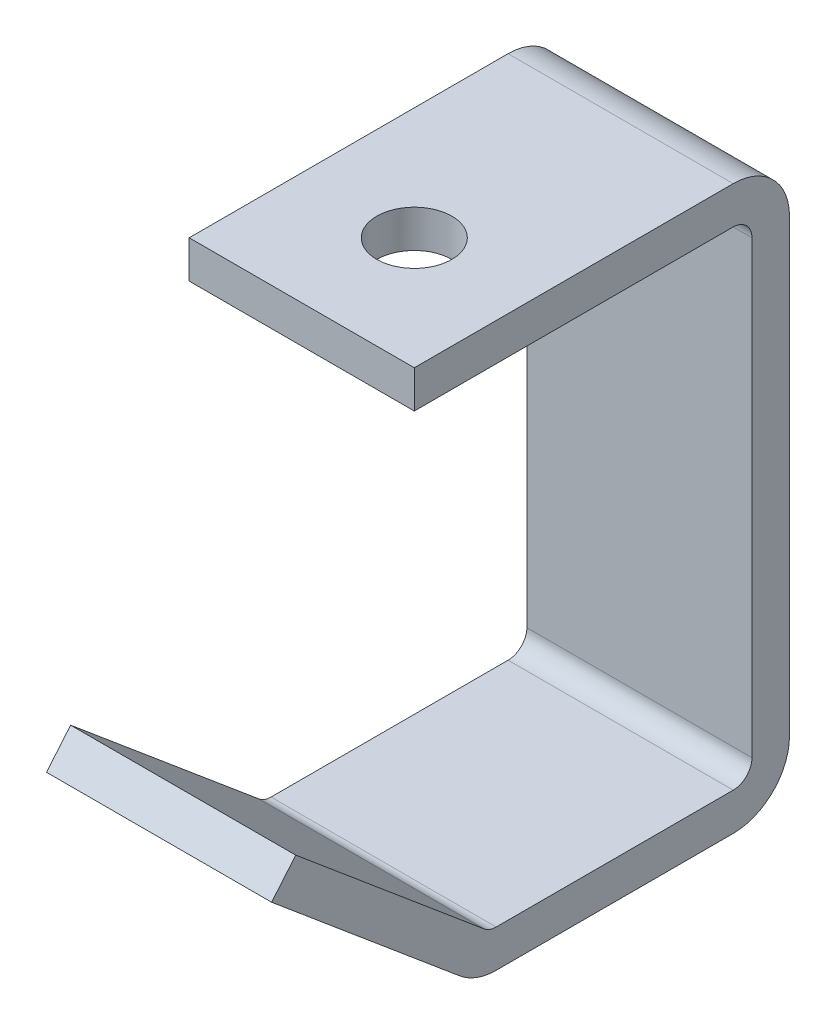
ISO-10303-21;
HEADER;
FILE_DESCRIPTION(('STEP AP214'),'2;1');
FILE_NAME('part.step','',(''),(''),'','','');
FILE_SCHEMA(('AUTOMOTIVE_DESIGN { 1 0 10303 214 1 1 1 1 }'));
ENDSEC;
DATA;
#1=APPLICATION_CONTEXT('core data for automotive mechanical design processes');
#2=APPLICATION_PROTOCOL_DEFINITION('international standard','automotive_design',2000,#1);
#3=PRODUCT_CONTEXT('',#1,'mechanical');
#4=PRODUCT('Part','Part','',(#3));
#5=PRODUCT_RELATED_PRODUCT_CATEGORY('part','',(#4));
#6=PRODUCT_DEFINITION_FORMATION('','',#4);
#7=PRODUCT_DEFINITION_CONTEXT('part definition',#1,'design');
#8=PRODUCT_DEFINITION('design','',#6,#7);
#9=PRODUCT_DEFINITION_SHAPE('','',#8);
#10=(LENGTH_UNIT() NAMED_UNIT(*) SI_UNIT(.MILLI.,.METRE.));
#11=(NAMED_UNIT(*) PLANE_ANGLE_UNIT() SI_UNIT($,.RADIAN.));
#12=(NAMED_UNIT(*) SI_UNIT($,.STERADIAN.) SOLID_ANGLE_UNIT());
#13=UNCERTAINTY_MEASURE_WITH_UNIT(LENGTH_MEASURE(1.E-05),#10,'distance_accuracy_value','');
#14=(GEOMETRIC_REPRESENTATION_CONTEXT(3) GLOBAL_UNCERTAINTY_ASSIGNED_CONTEXT((#13)) GLOBAL_UNIT_ASSIGNED_CONTEXT((#10,
#11,#12)) REPRESENTATION_CONTEXT('',''));
#15=CARTESIAN_POINT('',(0.,0.,0.));
#16=DIRECTION('',(0.,0.,1.));
#17=DIRECTION('',(1.,0.,0.));
#18=AXIS2_PLACEMENT_3D('',#15,#16,#17);
#19=CARTESIAN_POINT('',(19.05,88.9,3.175));
#20=DIRECTION('',(0.,-1.,0.));
#21=DIRECTION('',(0.,0.,-1.));
#22=AXIS2_PLACEMENT_3D('',#19,#20,#21);
#23=PLANE('',#22);
#24=CARTESIAN_POINT('',(0.,88.9,38.1));
#25=DIRECTION('',(0.,1.,0.));
#26=DIRECTION('',(0.,0.,1.));
#27=AXIS2_PLACEMENT_3D('',#24,#25,#26);
#28=CIRCLE('',#27,6.35);
#29=CARTESIAN_POINT('',(0.,88.9,44.45));
#30=VERTEX_POINT('',#29);
#31=EDGE_CURVE('E218',#30,#30,#28,.T.);
#32=ORIENTED_EDGE('',*,*,#31,.F.);
#33=EDGE_LOOP('',(#32));
#34=FACE_BOUND('',#33,.T.);
#35=DIRECTION('',(0.,0.,1.));
#36=VECTOR('',#35,1.);
#37=CARTESIAN_POINT('',(-19.05,88.9,3.175));
#38=LINE('',#37,#36);
#39=CARTESIAN_POINT('',(-19.05,88.9,3.175));
#40=VERTEX_POINT('',#39);
#41=CARTESIAN_POINT('',(-19.05,88.9,57.15));
#42=VERTEX_POINT('',#41);
#43=EDGE_CURVE('E213',#40,#42,#38,.T.);
#44=ORIENTED_EDGE('',*,*,#43,.T.);
#45=DIRECTION('',(-1.,0.,0.));
#46=VECTOR('',#45,1.);
#47=CARTESIAN_POINT('',(19.05,88.9,57.15));
#48=LINE('',#47,#46);
#49=CARTESIAN_POINT('',(19.05,88.9,57.15));
#50=VERTEX_POINT('',#49);
#51=EDGE_CURVE('E11',#50,#42,#48,.T.);
#52=ORIENTED_EDGE('',*,*,#51,.F.);
#53=DIRECTION('',(0.,0.,1.));
#54=VECTOR('',#53,1.);
#55=CARTESIAN_POINT('',(19.05,88.9,3.175));
#56=LINE('',#55,#54);
#57=CARTESIAN_POINT('',(19.05,88.9,3.175));
#58=VERTEX_POINT('',#57);
#59=EDGE_CURVE('E136',#58,#50,#56,.T.);
#60=ORIENTED_EDGE('',*,*,#59,.F.);
#61=DIRECTION('',(-1.,0.,0.));
#62=VECTOR('',#61,1.);
#63=CARTESIAN_POINT('',(19.05,88.9,3.175));
#64=LINE('',#63,#62);
#65=EDGE_CURVE('E209',#58,#40,#64,.T.);
#66=ORIENTED_EDGE('',*,*,#65,.T.);
#67=EDGE_LOOP('',(#44,#52,#60,#66));
#68=FACE_BOUND('',#67,.T.);
#69=ADVANCED_FACE('F38',(#34,#68),#23,.F.);
#70=CARTESIAN_POINT('',(19.05,82.55,57.15));
#71=DIRECTION('',(0.,0.,1.));
#72=DIRECTION('',(1.,0.,0.));
#73=AXIS2_PLACEMENT_3D('',#70,#71,#72);
#74=PLANE('',#73);
#75=DIRECTION('',(0.,1.,0.));
#76=VECTOR('',#75,1.);
#77=CARTESIAN_POINT('',(-19.05,82.55,57.15));
#78=LINE('',#77,#76);
#79=CARTESIAN_POINT('',(-19.05,82.55,57.15));
#80=VERTEX_POINT('',#79);
#81=EDGE_CURVE('E217',#80,#42,#78,.T.);
#82=ORIENTED_EDGE('',*,*,#81,.F.);
#83=DIRECTION('',(-1.,0.,0.));
#84=VECTOR('',#83,1.);
#85=CARTESIAN_POINT('',(19.05,82.55,57.15));
#86=LINE('',#85,#84);
#87=CARTESIAN_POINT('',(19.05,82.55,57.15));
#88=VERTEX_POINT('',#87);
#89=EDGE_CURVE('E47',#88,#80,#86,.T.);
#90=ORIENTED_EDGE('',*,*,#89,.F.);
#91=DIRECTION('',(0.,1.,0.));
#92=VECTOR('',#91,1.);
#93=CARTESIAN_POINT('',(19.05,82.55,57.15));
#94=LINE('',#93,#92);
#95=EDGE_CURVE('E328',#88,#50,#94,.T.);
#96=ORIENTED_EDGE('',*,*,#95,.T.);
#97=ORIENTED_EDGE('',*,*,#51,.T.);
#98=EDGE_LOOP('',(#82,#90,#96,#97));
#99=FACE_BOUND('',#98,.T.);
#100=ADVANCED_FACE('F315',(#99),#74,.T.);
#101=CARTESIAN_POINT('',(19.05,82.55,3.175));
#102=DIRECTION('',(0.,-1.,0.));
#103=DIRECTION('',(0.,0.,-1.));
#104=AXIS2_PLACEMENT_3D('',#101,#102,#103);
#105=PLANE('',#104);
#106=CARTESIAN_POINT('',(0.,82.55,38.1));
#107=DIRECTION('',(0.,-1.,0.));
#108=DIRECTION('',(0.,0.,-1.));
#109=AXIS2_PLACEMENT_3D('',#106,#107,#108);
#110=CIRCLE('',#109,6.35);
#111=CARTESIAN_POINT('',(0.,82.55,31.75));
#112=VERTEX_POINT('',#111);
#113=EDGE_CURVE('E396',#112,#112,#110,.F.);
#114=ORIENTED_EDGE('',*,*,#113,.T.);
#115=EDGE_LOOP('',(#114));
#116=FACE_BOUND('',#115,.T.);
#117=DIRECTION('',(0.,0.,1.));
#118=VECTOR('',#117,1.);
#119=CARTESIAN_POINT('',(-19.05,82.55,3.175));
#120=LINE('',#119,#118);
#121=CARTESIAN_POINT('',(-19.05,82.55,3.175));
#122=VERTEX_POINT('',#121);
#123=EDGE_CURVE('E221',#122,#80,#120,.T.);
#124=ORIENTED_EDGE('',*,*,#123,.F.);
#125=DIRECTION('',(-1.,0.,0.));
#126=VECTOR('',#125,1.);
#127=CARTESIAN_POINT('',(19.05,82.55,3.175));
#128=LINE('',#127,#126);
#129=CARTESIAN_POINT('',(19.05,82.55,3.175));
#130=VERTEX_POINT('',#129);
#131=EDGE_CURVE('E301',#130,#122,#128,.T.);
#132=ORIENTED_EDGE('',*,*,#131,.F.);
#133=DIRECTION('',(0.,0.,1.));
#134=VECTOR('',#133,1.);
#135=CARTESIAN_POINT('',(19.05,82.55,3.175));
#136=LINE('',#135,#134);
#137=EDGE_CURVE('E312',#130,#88,#136,.T.);
#138=ORIENTED_EDGE('',*,*,#137,.T.);
#139=ORIENTED_EDGE('',*,*,#89,.T.);
#140=EDGE_LOOP('',(#124,#132,#138,#139));
#141=FACE_BOUND('',#140,.T.);
#142=ADVANCED_FACE('F310',(#116,#141),#105,.T.);
#143=CARTESIAN_POINT('',(19.05,79.375,3.175));
#144=DIRECTION('',(-1.,0.,0.));
#145=DIRECTION('',(0.,0.,1.));
#146=AXIS2_PLACEMENT_3D('',#143,#144,#145);
#147=CYLINDRICAL_SURFACE('',#146,3.175);
#148=CARTESIAN_POINT('',(-19.05,79.375,3.175));
#149=DIRECTION('',(1.,0.,0.));
#150=DIRECTION('',(0.,0.,-1.));
#151=AXIS2_PLACEMENT_3D('',#148,#149,#150);
#152=CIRCLE('',#151,3.175);
#153=CARTESIAN_POINT('',(-19.05,79.375,0.));
#154=VERTEX_POINT('',#153);
#155=EDGE_CURVE('E225',#154,#122,#152,.T.);
#156=ORIENTED_EDGE('',*,*,#155,.F.);
#157=DIRECTION('',(-1.,0.,0.));
#158=VECTOR('',#157,1.);
#159=CARTESIAN_POINT('',(19.05,79.375,0.));
#160=LINE('',#159,#158);
#161=CARTESIAN_POINT('',(19.05,79.375,0.));
#162=VERTEX_POINT('',#161);
#163=EDGE_CURVE('E299',#162,#154,#160,.T.);
#164=ORIENTED_EDGE('',*,*,#163,.F.);
#165=CARTESIAN_POINT('',(19.05,79.375,3.175));
#166=DIRECTION('',(1.,0.,0.));
#167=DIRECTION('',(0.,0.,-1.));
#168=AXIS2_PLACEMENT_3D('',#165,#166,#167);
#169=CIRCLE('',#168,3.175);
#170=EDGE_CURVE('E325',#162,#130,#169,.T.);
#171=ORIENTED_EDGE('',*,*,#170,.T.);
#172=ORIENTED_EDGE('',*,*,#131,.T.);
#173=EDGE_LOOP('',(#156,#164,#171,#172));
#174=FACE_BOUND('',#173,.T.);
#175=ADVANCED_FACE('F322',(#174),#147,.F.);
#176=CARTESIAN_POINT('',(19.05,3.175,0.));
#177=DIRECTION('',(0.,0.,1.));
#178=DIRECTION('',(1.,0.,0.));
#179=AXIS2_PLACEMENT_3D('',#176,#177,#178);
#180=PLANE('',#179);
#181=DIRECTION('',(0.,1.,0.));
#182=VECTOR('',#181,1.);
#183=CARTESIAN_POINT('',(-19.05,3.175,0.));
#184=LINE('',#183,#182);
#185=CARTESIAN_POINT('',(-19.05,3.175,0.));
#186=VERTEX_POINT('',#185);
#187=EDGE_CURVE('E229',#186,#154,#184,.T.);
#188=ORIENTED_EDGE('',*,*,#187,.F.);
#189=DIRECTION('',(-1.,0.,0.));
#190=VECTOR('',#189,1.);
#191=CARTESIAN_POINT('',(19.05,3.175,0.));
#192=LINE('',#191,#190);
#193=CARTESIAN_POINT('',(19.05,3.175,0.));
#194=VERTEX_POINT('',#193);
#195=EDGE_CURVE('E296',#194,#186,#192,.T.);
#196=ORIENTED_EDGE('',*,*,#195,.F.);
#197=DIRECTION('',(0.,1.,0.));
#198=VECTOR('',#197,1.);
#199=CARTESIAN_POINT('',(19.05,3.175,0.));
#200=LINE('',#199,#198);
#201=EDGE_CURVE('E333',#194,#162,#200,.T.);
#202=ORIENTED_EDGE('',*,*,#201,.T.);
#203=ORIENTED_EDGE('',*,*,#163,.T.);
#204=EDGE_LOOP('',(#188,#196,#202,#203));
#205=FACE_BOUND('',#204,.T.);
#206=ADVANCED_FACE('F451',(#205),#180,.T.);
#207=CARTESIAN_POINT('',(19.05,3.175,3.175));
#208=DIRECTION('',(-1.,0.,0.));
#209=DIRECTION('',(0.,0.,1.));
#210=AXIS2_PLACEMENT_3D('',#207,#208,#209);
#211=CYLINDRICAL_SURFACE('',#210,3.175);
#212=CARTESIAN_POINT('',(-19.05,3.175,3.175));
#213=DIRECTION('',(1.,0.,0.));
#214=DIRECTION('',(0.,0.,1.));
#215=AXIS2_PLACEMENT_3D('',#212,#213,#214);
#216=CIRCLE('',#215,3.175);
#217=CARTESIAN_POINT('',(-19.05,0.,3.175));
#218=VERTEX_POINT('',#217);
#219=EDGE_CURVE('E233',#218,#186,#216,.T.);
#220=ORIENTED_EDGE('',*,*,#219,.F.);
#221=DIRECTION('',(-1.,0.,0.));
#222=VECTOR('',#221,1.);
#223=CARTESIAN_POINT('',(19.05,0.,3.175));
#224=LINE('',#223,#222);
#225=CARTESIAN_POINT('',(19.05,0.,3.175));
#226=VERTEX_POINT('',#225);
#227=EDGE_CURVE('E293',#226,#218,#224,.T.);
#228=ORIENTED_EDGE('',*,*,#227,.F.);
#229=CARTESIAN_POINT('',(19.05,3.175,3.175));
#230=DIRECTION('',(1.,0.,0.));
#231=DIRECTION('',(0.,0.,1.));
#232=AXIS2_PLACEMENT_3D('',#229,#230,#231);
#233=CIRCLE('',#232,3.175);
#234=EDGE_CURVE('E340',#226,#194,#233,.T.);
#235=ORIENTED_EDGE('',*,*,#234,.T.);
#236=ORIENTED_EDGE('',*,*,#195,.T.);
#237=EDGE_LOOP('',(#220,#228,#235,#236));
#238=FACE_BOUND('',#237,.T.);
#239=ADVANCED_FACE('F427',(#238),#211,.F.);
#240=CARTESIAN_POINT('',(19.05,0.,43.2943945062048));
#241=DIRECTION('',(0.,1.,0.));
#242=DIRECTION('',(0.,0.,1.));
#243=AXIS2_PLACEMENT_3D('',#240,#241,#242);
#244=PLANE('',#243);
#245=DIRECTION('',(0.,0.,-1.));
#246=VECTOR('',#245,1.);
#247=CARTESIAN_POINT('',(-19.05,0.,43.2943945062048));
#248=LINE('',#247,#246);
#249=CARTESIAN_POINT('',(-19.05,0.,43.2943945062048));
#250=VERTEX_POINT('',#249);
#251=EDGE_CURVE('E237',#250,#218,#248,.T.);
#252=ORIENTED_EDGE('',*,*,#251,.F.);
#253=DIRECTION('',(-1.,0.,0.));
#254=VECTOR('',#253,1.);
#255=CARTESIAN_POINT('',(19.05,0.,43.2943945062048));
#256=LINE('',#255,#254);
#257=CARTESIAN_POINT('',(19.05,0.,43.2943945062048));
#258=VERTEX_POINT('',#257);
#259=EDGE_CURVE('E290',#258,#250,#256,.T.);
#260=ORIENTED_EDGE('',*,*,#259,.F.);
#261=DIRECTION('',(0.,0.,-1.));
#262=VECTOR('',#261,1.);
#263=CARTESIAN_POINT('',(19.05,0.,43.2943945062048));
#264=LINE('',#263,#262);
#265=EDGE_CURVE('E344',#258,#226,#264,.T.);
#266=ORIENTED_EDGE('',*,*,#265,.T.);
#267=ORIENTED_EDGE('',*,*,#227,.T.);
#268=EDGE_LOOP('',(#252,#260,#266,#267));
#269=FACE_BOUND('',#268,.T.);
#270=ADVANCED_FACE('F422',(#269),#244,.T.);
#271=CARTESIAN_POINT('',(19.05,3.175,43.2943945062048));
#272=DIRECTION('',(-1.,0.,0.));
#273=DIRECTION('',(0.,0.,1.));
#274=AXIS2_PLACEMENT_3D('',#271,#272,#273);
#275=CYLINDRICAL_SURFACE('',#274,3.175);
#276=CARTESIAN_POINT('',(-19.05,3.175,43.2943945062048));
#277=DIRECTION('',(1.,0.,0.));
#278=DIRECTION('',(0.,0.,-1.));
#279=AXIS2_PLACEMENT_3D('',#276,#277,#278);
#280=CIRCLE('',#279,3.175);
#281=CARTESIAN_POINT('',(-19.05,0.742808893097251,45.3352451669596));
#282=VERTEX_POINT('',#281);
#283=EDGE_CURVE('E241',#282,#250,#280,.T.);
#284=ORIENTED_EDGE('',*,*,#283,.F.);
#285=DIRECTION('',(-1.,0.,0.));
#286=VECTOR('',#285,1.);
#287=CARTESIAN_POINT('',(19.05,0.742808893097251,45.3352451669596));
#288=LINE('',#287,#286);
#289=CARTESIAN_POINT('',(19.05,0.742808893097251,45.3352451669596));
#290=VERTEX_POINT('',#289);
#291=EDGE_CURVE('E287',#290,#282,#288,.T.);
#292=ORIENTED_EDGE('',*,*,#291,.F.);
#293=CARTESIAN_POINT('',(19.05,3.175,43.2943945062048));
#294=DIRECTION('',(1.,0.,0.));
#295=DIRECTION('',(0.,0.,-1.));
#296=AXIS2_PLACEMENT_3D('',#293,#294,#295);
#297=CIRCLE('',#296,3.175);
#298=EDGE_CURVE('E348',#290,#258,#297,.T.);
#299=ORIENTED_EDGE('',*,*,#298,.T.);
#300=ORIENTED_EDGE('',*,*,#259,.T.);
#301=EDGE_LOOP('',(#284,#292,#299,#300));
#302=FACE_BOUND('',#301,.T.);
#303=ADVANCED_FACE('F426',(#302),#275,.F.);
#304=CARTESIAN_POINT('',(19.05,27.4943401016882,77.2164785921939));
#305=DIRECTION('',(0.,0.766044443118977,-0.64278760968654));
#306=DIRECTION('',(0.,0.64278760968654,0.766044443118977));
#307=AXIS2_PLACEMENT_3D('',#304,#305,#306);
#308=PLANE('',#307);
#309=DIRECTION('',(0.,-0.64278760968654,-0.766044443118977));
#310=VECTOR('',#309,1.);
#311=CARTESIAN_POINT('',(-19.05,27.4943401016882,77.2164785921939));
#312=LINE('',#311,#310);
#313=CARTESIAN_POINT('',(-19.05,27.4943401016882,77.2164785921939));
#314=VERTEX_POINT('',#313);
#315=EDGE_CURVE('E244',#314,#282,#312,.T.);
#316=ORIENTED_EDGE('',*,*,#315,.F.);
#317=DIRECTION('',(-1.,0.,0.));
#318=VECTOR('',#317,1.);
#319=CARTESIAN_POINT('',(19.05,27.4943401016882,77.2164785921939));
#320=LINE('',#319,#318);
#321=CARTESIAN_POINT('',(19.05,27.4943401016882,77.2164785921939));
#322=VERTEX_POINT('',#321);
#323=EDGE_CURVE('E284',#322,#314,#320,.T.);
#324=ORIENTED_EDGE('',*,*,#323,.F.);
#325=DIRECTION('',(0.,-0.64278760968654,-0.766044443118977));
#326=VECTOR('',#325,1.);
#327=CARTESIAN_POINT('',(19.05,27.4943401016882,77.2164785921939));
#328=LINE('',#327,#326);
#329=EDGE_CURVE('E352',#322,#290,#328,.T.);
#330=ORIENTED_EDGE('',*,*,#329,.T.);
#331=ORIENTED_EDGE('',*,*,#291,.T.);
#332=EDGE_LOOP('',(#316,#324,#330,#331));
#333=FACE_BOUND('',#332,.T.);
#334=ADVANCED_FACE('F475',(#333),#308,.T.);
#335=CARTESIAN_POINT('',(19.05,22.6299578878827,81.2981799137034));
#336=DIRECTION('',(0.,0.642787609686541,0.766044443118977));
#337=DIRECTION('',(0.,-0.766044443118977,0.642787609686541));
#338=AXIS2_PLACEMENT_3D('',#335,#336,#337);
#339=PLANE('',#338);
#340=DIRECTION('',(0.,0.766044443118977,-0.642787609686541));
#341=VECTOR('',#340,1.);
#342=CARTESIAN_POINT('',(-19.05,22.6299578878827,81.2981799137034));
#343=LINE('',#342,#341);
#344=CARTESIAN_POINT('',(-19.05,22.6299578878827,81.2981799137034));
#345=VERTEX_POINT('',#344);
#346=EDGE_CURVE('E248',#345,#314,#343,.T.);
#347=ORIENTED_EDGE('',*,*,#346,.F.);
#348=DIRECTION('',(-1.,0.,0.));
#349=VECTOR('',#348,1.);
#350=CARTESIAN_POINT('',(19.05,22.6299578878827,81.2981799137034));
#351=LINE('',#350,#349);
#352=CARTESIAN_POINT('',(19.05,22.6299578878827,81.2981799137034));
#353=VERTEX_POINT('',#352);
#354=EDGE_CURVE('E281',#353,#345,#351,.T.);
#355=ORIENTED_EDGE('',*,*,#354,.F.);
#356=DIRECTION('',(0.,0.766044443118977,-0.642787609686541));
#357=VECTOR('',#356,1.);
#358=CARTESIAN_POINT('',(19.05,22.6299578878827,81.2981799137034));
#359=LINE('',#358,#357);
#360=EDGE_CURVE('E356',#353,#322,#359,.T.);
#361=ORIENTED_EDGE('',*,*,#360,.T.);
#362=ORIENTED_EDGE('',*,*,#323,.T.);
#363=EDGE_LOOP('',(#347,#355,#361,#362));
#364=FACE_BOUND('',#363,.T.);
#365=ADVANCED_FACE('F471',(#364),#339,.T.);
#366=CARTESIAN_POINT('',(19.05,22.6299578878827,81.2981799137034));
#367=DIRECTION('',(0.,0.766044443118977,-0.64278760968654));
#368=DIRECTION('',(0.,0.64278760968654,0.766044443118977));
#369=AXIS2_PLACEMENT_3D('',#366,#367,#368);
#370=PLANE('',#369);
#371=DIRECTION('',(0.,-0.64278760968654,-0.766044443118977));
#372=VECTOR('',#371,1.);
#373=CARTESIAN_POINT('',(-19.05,22.6299578878827,81.2981799137034));
#374=LINE('',#373,#372);
#375=CARTESIAN_POINT('',(-19.05,-4.12157332070825,49.4169464884691));
#376=VERTEX_POINT('',#375);
#377=EDGE_CURVE('E252',#345,#376,#374,.T.);
#378=ORIENTED_EDGE('',*,*,#377,.T.);
#379=DIRECTION('',(-1.,0.,0.));
#380=VECTOR('',#379,1.);
#381=CARTESIAN_POINT('',(19.05,-4.12157332070825,49.4169464884691));
#382=LINE('',#381,#380);
#383=CARTESIAN_POINT('',(19.05,-4.12157332070825,49.4169464884691));
#384=VERTEX_POINT('',#383);
#385=EDGE_CURVE('E277',#384,#376,#382,.T.);
#386=ORIENTED_EDGE('',*,*,#385,.F.);
#387=DIRECTION('',(0.,-0.64278760968654,-0.766044443118977));
#388=VECTOR('',#387,1.);
#389=CARTESIAN_POINT('',(19.05,22.6299578878827,81.2981799137034));
#390=LINE('',#389,#388);
#391=EDGE_CURVE('E360',#353,#384,#390,.T.);
#392=ORIENTED_EDGE('',*,*,#391,.F.);
#393=ORIENTED_EDGE('',*,*,#354,.T.);
#394=EDGE_LOOP('',(#378,#386,#392,#393));
#395=FACE_BOUND('',#394,.T.);
#396=ADVANCED_FACE('F474',(#395),#370,.F.);
#397=CARTESIAN_POINT('',(19.05,3.175,43.2943945062048));
#398=DIRECTION('',(-1.,0.,0.));
#399=DIRECTION('',(0.,0.,1.));
#400=AXIS2_PLACEMENT_3D('',#397,#398,#399);
#401=CYLINDRICAL_SURFACE('',#400,9.525);
#402=CARTESIAN_POINT('',(-19.05,3.175,43.2943945062048));
#403=DIRECTION('',(1.,0.,0.));
#404=DIRECTION('',(0.,0.,-1.));
#405=AXIS2_PLACEMENT_3D('',#402,#403,#404);
#406=CIRCLE('',#405,9.525);
#407=CARTESIAN_POINT('',(-19.05,-6.35,43.2943945062048));
#408=VERTEX_POINT('',#407);
#409=EDGE_CURVE('E255',#376,#408,#406,.T.);
#410=ORIENTED_EDGE('',*,*,#409,.T.);
#411=DIRECTION('',(-1.,0.,0.));
#412=VECTOR('',#411,1.);
#413=CARTESIAN_POINT('',(19.05,-6.35,43.2943945062048));
#414=LINE('',#413,#412);
#415=CARTESIAN_POINT('',(19.05,-6.35,43.2943945062048));
#416=VERTEX_POINT('',#415);
#417=EDGE_CURVE('E273',#416,#408,#414,.T.);
#418=ORIENTED_EDGE('',*,*,#417,.F.);
#419=CARTESIAN_POINT('',(19.05,3.175,43.2943945062048));
#420=DIRECTION('',(1.,0.,0.));
#421=DIRECTION('',(0.,0.,-1.));
#422=AXIS2_PLACEMENT_3D('',#419,#420,#421);
#423=CIRCLE('',#422,9.525);
#424=EDGE_CURVE('E363',#384,#416,#423,.T.);
#425=ORIENTED_EDGE('',*,*,#424,.F.);
#426=ORIENTED_EDGE('',*,*,#385,.T.);
#427=EDGE_LOOP('',(#410,#418,#425,#426));
#428=FACE_BOUND('',#427,.T.);
#429=ADVANCED_FACE('F372',(#428),#401,.T.);
#430=CARTESIAN_POINT('',(19.05,-6.35,43.2943945062048));
#431=DIRECTION('',(0.,1.,0.));
#432=DIRECTION('',(0.,0.,1.));
#433=AXIS2_PLACEMENT_3D('',#430,#431,#432);
#434=PLANE('',#433);
#435=DIRECTION('',(0.,0.,-1.));
#436=VECTOR('',#435,1.);
#437=CARTESIAN_POINT('',(-19.05,-6.35,43.2943945062048));
#438=LINE('',#437,#436);
#439=CARTESIAN_POINT('',(-19.05,-6.35,3.17499999999999));
#440=VERTEX_POINT('',#439);
#441=EDGE_CURVE('E258',#408,#440,#438,.T.);
#442=ORIENTED_EDGE('',*,*,#441,.T.);
#443=DIRECTION('',(-1.,0.,0.));
#444=VECTOR('',#443,1.);
#445=CARTESIAN_POINT('',(19.05,-6.35,3.17499999999999));
#446=LINE('',#445,#444);
#447=CARTESIAN_POINT('',(19.05,-6.35,3.17499999999999));
#448=VERTEX_POINT('',#447);
#449=EDGE_CURVE('E200',#448,#440,#446,.T.);
#450=ORIENTED_EDGE('',*,*,#449,.F.);
#451=DIRECTION('',(0.,0.,-1.));
#452=VECTOR('',#451,1.);
#453=CARTESIAN_POINT('',(19.05,-6.35,43.2943945062048));
#454=LINE('',#453,#452);
#455=EDGE_CURVE('E189',#416,#448,#454,.T.);
#456=ORIENTED_EDGE('',*,*,#455,.F.);
#457=ORIENTED_EDGE('',*,*,#417,.T.);
#458=EDGE_LOOP('',(#442,#450,#456,#457));
#459=FACE_BOUND('',#458,.T.);
#460=ADVANCED_FACE('F376',(#459),#434,.F.);
#461=CARTESIAN_POINT('',(19.05,3.175,3.175));
#462=DIRECTION('',(-1.,0.,0.));
#463=DIRECTION('',(0.,0.,1.));
#464=AXIS2_PLACEMENT_3D('',#461,#462,#463);
#465=CYLINDRICAL_SURFACE('',#464,9.525);
#466=CARTESIAN_POINT('',(-19.05,3.175,3.175));
#467=DIRECTION('',(1.,0.,0.));
#468=DIRECTION('',(0.,0.,-1.));
#469=AXIS2_PLACEMENT_3D('',#466,#467,#468);
#470=CIRCLE('',#469,9.525);
#471=CARTESIAN_POINT('',(-19.05,3.175,-6.35));
#472=VERTEX_POINT('',#471);
#473=EDGE_CURVE('E198',#440,#472,#470,.T.);
#474=ORIENTED_EDGE('',*,*,#473,.T.);
#475=DIRECTION('',(-1.,0.,0.));
#476=VECTOR('',#475,1.);
#477=CARTESIAN_POINT('',(19.05,3.175,-6.35));
#478=LINE('',#477,#476);
#479=CARTESIAN_POINT('',(19.05,3.175,-6.35));
#480=VERTEX_POINT('',#479);
#481=EDGE_CURVE('E195',#480,#472,#478,.T.);
#482=ORIENTED_EDGE('',*,*,#481,.F.);
#483=CARTESIAN_POINT('',(19.05,3.175,3.175));
#484=DIRECTION('',(1.,0.,0.));
#485=DIRECTION('',(0.,0.,-1.));
#486=AXIS2_PLACEMENT_3D('',#483,#484,#485);
#487=CIRCLE('',#486,9.525);
#488=EDGE_CURVE('E183',#448,#480,#487,.T.);
#489=ORIENTED_EDGE('',*,*,#488,.F.);
#490=ORIENTED_EDGE('',*,*,#449,.T.);
#491=EDGE_LOOP('',(#474,#482,#489,#490));
#492=FACE_BOUND('',#491,.T.);
#493=ADVANCED_FACE('F196',(#492),#465,.T.);
#494=CARTESIAN_POINT('',(19.05,3.175,-6.35));
#495=DIRECTION('',(0.,0.,1.));
#496=DIRECTION('',(1.,0.,0.));
#497=AXIS2_PLACEMENT_3D('',#494,#495,#496);
#498=PLANE('',#497);
#499=DIRECTION('',(0.,1.,0.));
#500=VECTOR('',#499,1.);
#501=CARTESIAN_POINT('',(-19.05,3.175,-6.35));
#502=LINE('',#501,#500);
#503=CARTESIAN_POINT('',(-19.05,79.375,-6.35));
#504=VERTEX_POINT('',#503);
#505=EDGE_CURVE('E119',#472,#504,#502,.T.);
#506=ORIENTED_EDGE('',*,*,#505,.T.);
#507=DIRECTION('',(-1.,0.,0.));
#508=VECTOR('',#507,1.);
#509=CARTESIAN_POINT('',(19.05,79.375,-6.35));
#510=LINE('',#509,#508);
#511=CARTESIAN_POINT('',(19.05,79.375,-6.35));
#512=VERTEX_POINT('',#511);
#513=EDGE_CURVE('E201',#512,#504,#510,.T.);
#514=ORIENTED_EDGE('',*,*,#513,.F.);
#515=DIRECTION('',(0.,1.,0.));
#516=VECTOR('',#515,1.);
#517=CARTESIAN_POINT('',(19.05,3.175,-6.35));
#518=LINE('',#517,#516);
#519=EDGE_CURVE('E187',#480,#512,#518,.T.);
#520=ORIENTED_EDGE('',*,*,#519,.F.);
#521=ORIENTED_EDGE('',*,*,#481,.T.);
#522=EDGE_LOOP('',(#506,#514,#520,#521));
#523=FACE_BOUND('',#522,.T.);
#524=ADVANCED_FACE('F203',(#523),#498,.F.);
#525=CARTESIAN_POINT('',(19.05,79.375,3.175));
#526=DIRECTION('',(-1.,0.,0.));
#527=DIRECTION('',(0.,0.,1.));
#528=AXIS2_PLACEMENT_3D('',#525,#526,#527);
#529=CYLINDRICAL_SURFACE('',#528,9.525);
#530=CARTESIAN_POINT('',(-19.05,79.375,3.175));
#531=DIRECTION('',(1.,0.,0.));
#532=DIRECTION('',(0.,0.,-1.));
#533=AXIS2_PLACEMENT_3D('',#530,#531,#532);
#534=CIRCLE('',#533,9.525);
#535=EDGE_CURVE('E127',#504,#40,#534,.T.);
#536=ORIENTED_EDGE('',*,*,#535,.T.);
#537=ORIENTED_EDGE('',*,*,#65,.F.);
#538=CARTESIAN_POINT('',(19.05,79.375,3.175));
#539=DIRECTION('',(1.,0.,0.));
#540=DIRECTION('',(0.,0.,-1.));
#541=AXIS2_PLACEMENT_3D('',#538,#539,#540);
#542=CIRCLE('',#541,9.525);
#543=EDGE_CURVE('E58',#512,#58,#542,.T.);
#544=ORIENTED_EDGE('',*,*,#543,.F.);
#545=ORIENTED_EDGE('',*,*,#513,.T.);
#546=EDGE_LOOP('',(#536,#537,#544,#545));
#547=FACE_BOUND('',#546,.T.);
#548=ADVANCED_FACE('F378',(#547),#529,.T.);
#549=CARTESIAN_POINT('',(19.05,79.375,3.175));
#550=DIRECTION('',(1.,0.,0.));
#551=DIRECTION('',(0.,0.,-1.));
#552=AXIS2_PLACEMENT_3D('',#549,#550,#551);
#553=PLANE('',#552);
#554=ORIENTED_EDGE('',*,*,#59,.T.);
#555=ORIENTED_EDGE('',*,*,#95,.F.);
#556=ORIENTED_EDGE('',*,*,#137,.F.);
#557=ORIENTED_EDGE('',*,*,#170,.F.);
#558=ORIENTED_EDGE('',*,*,#201,.F.);
#559=ORIENTED_EDGE('',*,*,#234,.F.);
#560=ORIENTED_EDGE('',*,*,#265,.F.);
#561=ORIENTED_EDGE('',*,*,#298,.F.);
#562=ORIENTED_EDGE('',*,*,#329,.F.);
#563=ORIENTED_EDGE('',*,*,#360,.F.);
#564=ORIENTED_EDGE('',*,*,#391,.T.);
#565=ORIENTED_EDGE('',*,*,#424,.T.);
#566=ORIENTED_EDGE('',*,*,#455,.T.);
#567=ORIENTED_EDGE('',*,*,#488,.T.);
#568=ORIENTED_EDGE('',*,*,#519,.T.);
#569=ORIENTED_EDGE('',*,*,#543,.T.);
#570=EDGE_LOOP('',(#554,#555,#556,#557,#558,#559,#560,#561,#562,#563,#564,#565,#566,#567,#568,#569));
#571=FACE_BOUND('',#570,.T.);
#572=ADVANCED_FACE('F185',(#571),#553,.T.);
#573=CARTESIAN_POINT('',(-19.05,79.375,3.175));
#574=DIRECTION('',(1.,0.,0.));
#575=DIRECTION('',(0.,0.,-1.));
#576=AXIS2_PLACEMENT_3D('',#573,#574,#575);
#577=PLANE('',#576);
#578=ORIENTED_EDGE('',*,*,#43,.F.);
#579=ORIENTED_EDGE('',*,*,#535,.F.);
#580=ORIENTED_EDGE('',*,*,#505,.F.);
#581=ORIENTED_EDGE('',*,*,#473,.F.);
#582=ORIENTED_EDGE('',*,*,#441,.F.);
#583=ORIENTED_EDGE('',*,*,#409,.F.);
#584=ORIENTED_EDGE('',*,*,#377,.F.);
#585=ORIENTED_EDGE('',*,*,#346,.T.);
#586=ORIENTED_EDGE('',*,*,#315,.T.);
#587=ORIENTED_EDGE('',*,*,#283,.T.);
#588=ORIENTED_EDGE('',*,*,#251,.T.);
#589=ORIENTED_EDGE('',*,*,#219,.T.);
#590=ORIENTED_EDGE('',*,*,#187,.T.);
#591=ORIENTED_EDGE('',*,*,#155,.T.);
#592=ORIENTED_EDGE('',*,*,#123,.T.);
#593=ORIENTED_EDGE('',*,*,#81,.T.);
#594=EDGE_LOOP('',(#578,#579,#580,#581,#582,#583,#584,#585,#586,#587,#588,#589,#590,#591,#592,#593));
#595=FACE_BOUND('',#594,.T.);
#596=ADVANCED_FACE('F318',(#595),#577,.F.);
#597=CARTESIAN_POINT('',(0.,-6.35100000000001,38.1000000000001));
#598=DIRECTION('',(0.,1.,0.));
#599=DIRECTION('',(0.,0.,1.));
#600=AXIS2_PLACEMENT_3D('',#597,#598,#599);
#601=CYLINDRICAL_SURFACE('',#600,6.35);
#602=ORIENTED_EDGE('',*,*,#113,.F.);
#603=EDGE_LOOP('',(#602));
#604=FACE_BOUND('',#603,.T.);
#605=ORIENTED_EDGE('',*,*,#31,.T.);
#606=EDGE_LOOP('',(#605));
#607=FACE_BOUND('',#606,.T.);
#608=ADVANCED_FACE('F403',(#604,#607),#601,.F.);
#609=CLOSED_SHELL('',(#69,#100,#142,#175,#206,#239,#270,#303,#334,#365,#396,#429,#460,#493,#524,
#548,#572,#596,#608));
#610=MANIFOLD_SOLID_BREP('B2',#609);
#611=ADVANCED_BREP_SHAPE_REPRESENTATION('',(#18,#610),#14);
#612=SHAPE_DEFINITION_REPRESENTATION(#9,#611);
ENDSEC;
END-ISO-10303-21;
